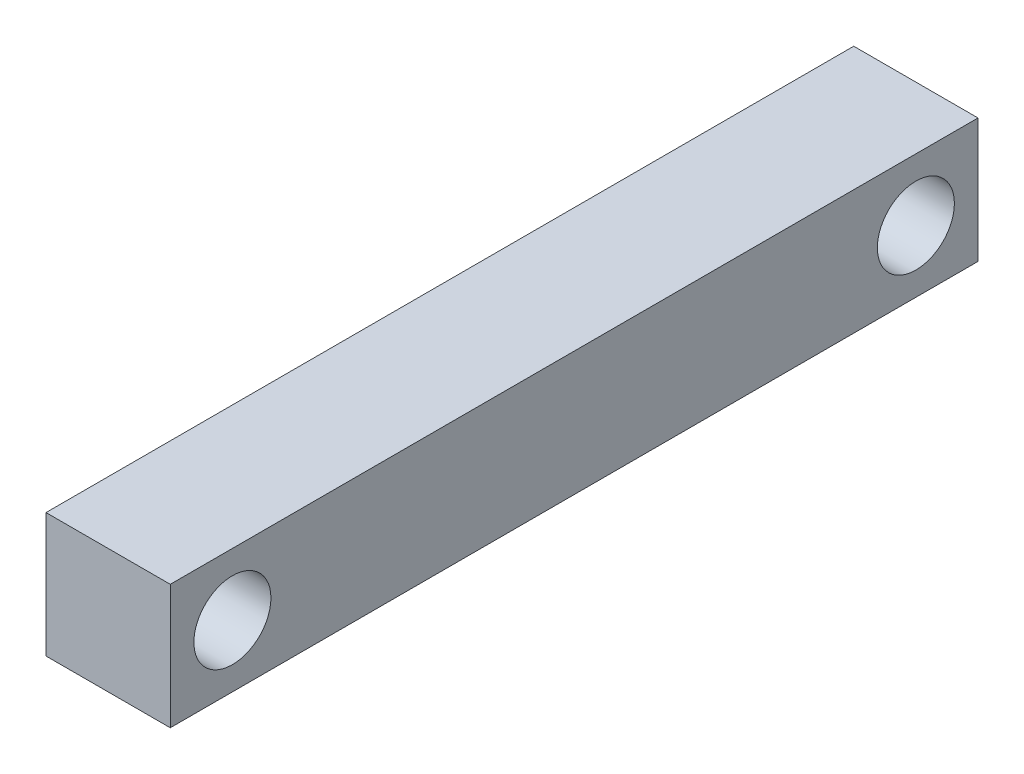
ISO-10303-21;
HEADER;
FILE_DESCRIPTION(('STEP AP214'),'2;1');
FILE_NAME('part.step','',(''),(''),'','','');
FILE_SCHEMA(('AUTOMOTIVE_DESIGN { 1 0 10303 214 1 1 1 1 }'));
ENDSEC;
DATA;
#1=APPLICATION_CONTEXT('core data for automotive mechanical design processes');
#2=APPLICATION_PROTOCOL_DEFINITION('international standard','automotive_design',2000,#1);
#3=PRODUCT_CONTEXT('',#1,'mechanical');
#4=PRODUCT('Part','Part','',(#3));
#5=PRODUCT_RELATED_PRODUCT_CATEGORY('part','',(#4));
#6=PRODUCT_DEFINITION_FORMATION('','',#4);
#7=PRODUCT_DEFINITION_CONTEXT('part definition',#1,'design');
#8=PRODUCT_DEFINITION('design','',#6,#7);
#9=PRODUCT_DEFINITION_SHAPE('','',#8);
#10=(LENGTH_UNIT() NAMED_UNIT(*) SI_UNIT(.MILLI.,.METRE.));
#11=(NAMED_UNIT(*) PLANE_ANGLE_UNIT() SI_UNIT($,.RADIAN.));
#12=(NAMED_UNIT(*) SI_UNIT($,.STERADIAN.) SOLID_ANGLE_UNIT());
#13=UNCERTAINTY_MEASURE_WITH_UNIT(LENGTH_MEASURE(1.E-05),#10,'distance_accuracy_value','');
#14=(GEOMETRIC_REPRESENTATION_CONTEXT(3) GLOBAL_UNCERTAINTY_ASSIGNED_CONTEXT((#13)) GLOBAL_UNIT_ASSIGNED_CONTEXT((#10,
#11,#12)) REPRESENTATION_CONTEXT('',''));
#15=CARTESIAN_POINT('',(0.,0.,0.));
#16=DIRECTION('',(0.,0.,1.));
#17=DIRECTION('',(1.,0.,0.));
#18=AXIS2_PLACEMENT_3D('',#15,#16,#17);
#19=CARTESIAN_POINT('',(10.,0.,0.));
#20=DIRECTION('',(1.,0.,0.));
#21=DIRECTION('',(0.,0.,-1.));
#22=AXIS2_PLACEMENT_3D('',#19,#20,#21);
#23=PLANE('',#22);
#24=CARTESIAN_POINT('',(10.,0.,27.5));
#25=DIRECTION('',(1.,0.,0.));
#26=DIRECTION('',(0.,0.,-1.));
#27=AXIS2_PLACEMENT_3D('',#24,#25,#26);
#28=CIRCLE('',#27,3.1);
#29=CARTESIAN_POINT('',(10.,0.,24.4));
#30=VERTEX_POINT('',#29);
#31=EDGE_CURVE('E101',#30,#30,#28,.T.);
#32=ORIENTED_EDGE('',*,*,#31,.F.);
#33=EDGE_LOOP('',(#32));
#34=FACE_BOUND('',#33,.T.);
#35=DIRECTION('',(0.,1.,0.));
#36=VECTOR('',#35,1.);
#37=CARTESIAN_POINT('',(10.,5.,-32.5));
#38=LINE('',#37,#36);
#39=CARTESIAN_POINT('',(10.,-5.,-32.5));
#40=VERTEX_POINT('',#39);
#41=CARTESIAN_POINT('',(10.,5.,-32.5));
#42=VERTEX_POINT('',#41);
#43=EDGE_CURVE('E86',#40,#42,#38,.T.);
#44=ORIENTED_EDGE('',*,*,#43,.T.);
#45=DIRECTION('',(0.,0.,1.));
#46=VECTOR('',#45,1.);
#47=CARTESIAN_POINT('',(10.,5.,32.5));
#48=LINE('',#47,#46);
#49=CARTESIAN_POINT('',(10.,5.,32.5));
#50=VERTEX_POINT('',#49);
#51=EDGE_CURVE('E81',#42,#50,#48,.T.);
#52=ORIENTED_EDGE('',*,*,#51,.T.);
#53=DIRECTION('',(0.,-1.,0.));
#54=VECTOR('',#53,1.);
#55=CARTESIAN_POINT('',(10.,5.,32.5));
#56=LINE('',#55,#54);
#57=CARTESIAN_POINT('',(10.,-5.,32.5));
#58=VERTEX_POINT('',#57);
#59=EDGE_CURVE('E84',#50,#58,#56,.T.);
#60=ORIENTED_EDGE('',*,*,#59,.T.);
#61=DIRECTION('',(0.,0.,-1.));
#62=VECTOR('',#61,1.);
#63=CARTESIAN_POINT('',(10.,-5.,32.5));
#64=LINE('',#63,#62);
#65=EDGE_CURVE('E51',#58,#40,#64,.T.);
#66=ORIENTED_EDGE('',*,*,#65,.T.);
#67=EDGE_LOOP('',(#44,#52,#60,#66));
#68=FACE_BOUND('',#67,.T.);
#69=CARTESIAN_POINT('',(10.,0.,-27.5));
#70=DIRECTION('',(1.,0.,0.));
#71=DIRECTION('',(0.,0.,-1.));
#72=AXIS2_PLACEMENT_3D('',#69,#70,#71);
#73=CIRCLE('',#72,3.1);
#74=CARTESIAN_POINT('',(10.,0.,-30.6));
#75=VERTEX_POINT('',#74);
#76=EDGE_CURVE('E116',#75,#75,#73,.T.);
#77=ORIENTED_EDGE('',*,*,#76,.F.);
#78=EDGE_LOOP('',(#77));
#79=FACE_BOUND('',#78,.T.);
#80=ADVANCED_FACE('F34',(#34,#68,#79),#23,.T.);
#81=CARTESIAN_POINT('',(0.,0.,0.));
#82=DIRECTION('',(1.,0.,0.));
#83=DIRECTION('',(0.,0.,-1.));
#84=AXIS2_PLACEMENT_3D('',#81,#82,#83);
#85=PLANE('',#84);
#86=DIRECTION('',(0.,1.,0.));
#87=VECTOR('',#86,1.);
#88=CARTESIAN_POINT('',(0.,5.,-32.5));
#89=LINE('',#88,#87);
#90=CARTESIAN_POINT('',(0.,-5.,-32.5));
#91=VERTEX_POINT('',#90);
#92=CARTESIAN_POINT('',(0.,5.,-32.5));
#93=VERTEX_POINT('',#92);
#94=EDGE_CURVE('E98',#91,#93,#89,.T.);
#95=ORIENTED_EDGE('',*,*,#94,.F.);
#96=DIRECTION('',(0.,0.,-1.));
#97=VECTOR('',#96,1.);
#98=CARTESIAN_POINT('',(0.,-5.,32.5));
#99=LINE('',#98,#97);
#100=CARTESIAN_POINT('',(0.,-5.,32.5));
#101=VERTEX_POINT('',#100);
#102=EDGE_CURVE('E74',#101,#91,#99,.T.);
#103=ORIENTED_EDGE('',*,*,#102,.F.);
#104=DIRECTION('',(0.,-1.,0.));
#105=VECTOR('',#104,1.);
#106=CARTESIAN_POINT('',(0.,5.,32.5));
#107=LINE('',#106,#105);
#108=CARTESIAN_POINT('',(0.,5.,32.5));
#109=VERTEX_POINT('',#108);
#110=EDGE_CURVE('E68',#109,#101,#107,.T.);
#111=ORIENTED_EDGE('',*,*,#110,.F.);
#112=DIRECTION('',(0.,0.,1.));
#113=VECTOR('',#112,1.);
#114=CARTESIAN_POINT('',(0.,5.,32.5));
#115=LINE('',#114,#113);
#116=EDGE_CURVE('E90',#93,#109,#115,.T.);
#117=ORIENTED_EDGE('',*,*,#116,.F.);
#118=EDGE_LOOP('',(#95,#103,#111,#117));
#119=FACE_BOUND('',#118,.T.);
#120=CARTESIAN_POINT('',(0.,0.,27.5));
#121=DIRECTION('',(1.,0.,0.));
#122=DIRECTION('',(0.,0.,-1.));
#123=AXIS2_PLACEMENT_3D('',#120,#121,#122);
#124=CIRCLE('',#123,3.1);
#125=CARTESIAN_POINT('',(0.,0.,24.4));
#126=VERTEX_POINT('',#125);
#127=EDGE_CURVE('E113',#126,#126,#124,.T.);
#128=ORIENTED_EDGE('',*,*,#127,.T.);
#129=EDGE_LOOP('',(#128));
#130=FACE_BOUND('',#129,.T.);
#131=CARTESIAN_POINT('',(0.,0.,-27.5));
#132=DIRECTION('',(1.,0.,0.));
#133=DIRECTION('',(0.,0.,-1.));
#134=AXIS2_PLACEMENT_3D('',#131,#132,#133);
#135=CIRCLE('',#134,3.1);
#136=CARTESIAN_POINT('',(0.,0.,-30.6));
#137=VERTEX_POINT('',#136);
#138=EDGE_CURVE('E119',#137,#137,#135,.T.);
#139=ORIENTED_EDGE('',*,*,#138,.T.);
#140=EDGE_LOOP('',(#139));
#141=FACE_BOUND('',#140,.T.);
#142=ADVANCED_FACE('F109',(#119,#130,#141),#85,.F.);
#143=CARTESIAN_POINT('',(10.,5.,-32.5));
#144=DIRECTION('',(0.,0.,1.));
#145=DIRECTION('',(1.,0.,0.));
#146=AXIS2_PLACEMENT_3D('',#143,#144,#145);
#147=PLANE('',#146);
#148=ORIENTED_EDGE('',*,*,#94,.T.);
#149=DIRECTION('',(-1.,0.,0.));
#150=VECTOR('',#149,1.);
#151=CARTESIAN_POINT('',(10.,5.,-32.5));
#152=LINE('',#151,#150);
#153=EDGE_CURVE('E11',#42,#93,#152,.T.);
#154=ORIENTED_EDGE('',*,*,#153,.F.);
#155=ORIENTED_EDGE('',*,*,#43,.F.);
#156=DIRECTION('',(-1.,0.,0.));
#157=VECTOR('',#156,1.);
#158=CARTESIAN_POINT('',(10.,-5.,-32.5));
#159=LINE('',#158,#157);
#160=EDGE_CURVE('E94',#40,#91,#159,.T.);
#161=ORIENTED_EDGE('',*,*,#160,.T.);
#162=EDGE_LOOP('',(#148,#154,#155,#161));
#163=FACE_BOUND('',#162,.T.);
#164=ADVANCED_FACE('F36',(#163),#147,.F.);
#165=CARTESIAN_POINT('',(10.,5.,32.5));
#166=DIRECTION('',(0.,-1.,0.));
#167=DIRECTION('',(0.,0.,-1.));
#168=AXIS2_PLACEMENT_3D('',#165,#166,#167);
#169=PLANE('',#168);
#170=ORIENTED_EDGE('',*,*,#116,.T.);
#171=DIRECTION('',(-1.,0.,0.));
#172=VECTOR('',#171,1.);
#173=CARTESIAN_POINT('',(10.,5.,32.5));
#174=LINE('',#173,#172);
#175=EDGE_CURVE('E43',#50,#109,#174,.T.);
#176=ORIENTED_EDGE('',*,*,#175,.F.);
#177=ORIENTED_EDGE('',*,*,#51,.F.);
#178=ORIENTED_EDGE('',*,*,#153,.T.);
#179=EDGE_LOOP('',(#170,#176,#177,#178));
#180=FACE_BOUND('',#179,.T.);
#181=ADVANCED_FACE('F89',(#180),#169,.F.);
#182=CARTESIAN_POINT('',(10.,5.,32.5));
#183=DIRECTION('',(0.,0.,-1.));
#184=DIRECTION('',(-1.,0.,0.));
#185=AXIS2_PLACEMENT_3D('',#182,#183,#184);
#186=PLANE('',#185);
#187=ORIENTED_EDGE('',*,*,#110,.T.);
#188=DIRECTION('',(-1.,0.,0.));
#189=VECTOR('',#188,1.);
#190=CARTESIAN_POINT('',(10.,-5.,32.5));
#191=LINE('',#190,#189);
#192=EDGE_CURVE('E91',#58,#101,#191,.T.);
#193=ORIENTED_EDGE('',*,*,#192,.F.);
#194=ORIENTED_EDGE('',*,*,#59,.F.);
#195=ORIENTED_EDGE('',*,*,#175,.T.);
#196=EDGE_LOOP('',(#187,#193,#194,#195));
#197=FACE_BOUND('',#196,.T.);
#198=ADVANCED_FACE('F92',(#197),#186,.F.);
#199=CARTESIAN_POINT('',(10.,-5.,32.5));
#200=DIRECTION('',(0.,1.,0.));
#201=DIRECTION('',(0.,0.,1.));
#202=AXIS2_PLACEMENT_3D('',#199,#200,#201);
#203=PLANE('',#202);
#204=ORIENTED_EDGE('',*,*,#102,.T.);
#205=ORIENTED_EDGE('',*,*,#160,.F.);
#206=ORIENTED_EDGE('',*,*,#65,.F.);
#207=ORIENTED_EDGE('',*,*,#192,.T.);
#208=EDGE_LOOP('',(#204,#205,#206,#207));
#209=FACE_BOUND('',#208,.T.);
#210=ADVANCED_FACE('F106',(#209),#203,.F.);
#211=CARTESIAN_POINT('',(10.,0.,27.5));
#212=DIRECTION('',(-1.,0.,0.));
#213=DIRECTION('',(0.,0.,1.));
#214=AXIS2_PLACEMENT_3D('',#211,#212,#213);
#215=CYLINDRICAL_SURFACE('',#214,3.1);
#216=ORIENTED_EDGE('',*,*,#31,.T.);
#217=EDGE_LOOP('',(#216));
#218=FACE_BOUND('',#217,.T.);
#219=ORIENTED_EDGE('',*,*,#127,.F.);
#220=EDGE_LOOP('',(#219));
#221=FACE_BOUND('',#220,.T.);
#222=ADVANCED_FACE('F136',(#218,#221),#215,.F.);
#223=CARTESIAN_POINT('',(10.,0.,-27.5));
#224=DIRECTION('',(-1.,0.,0.));
#225=DIRECTION('',(0.,0.,1.));
#226=AXIS2_PLACEMENT_3D('',#223,#224,#225);
#227=CYLINDRICAL_SURFACE('',#226,3.1);
#228=ORIENTED_EDGE('',*,*,#76,.T.);
#229=EDGE_LOOP('',(#228));
#230=FACE_BOUND('',#229,.T.);
#231=ORIENTED_EDGE('',*,*,#138,.F.);
#232=EDGE_LOOP('',(#231));
#233=FACE_BOUND('',#232,.T.);
#234=ADVANCED_FACE('F125',(#230,#233),#227,.F.);
#235=CLOSED_SHELL('',(#80,#142,#164,#181,#198,#210,#222,#234));
#236=MANIFOLD_SOLID_BREP('B2',#235);
#237=ADVANCED_BREP_SHAPE_REPRESENTATION('',(#18,#236),#14);
#238=SHAPE_DEFINITION_REPRESENTATION(#9,#237);
ENDSEC;
END-ISO-10303-21;
